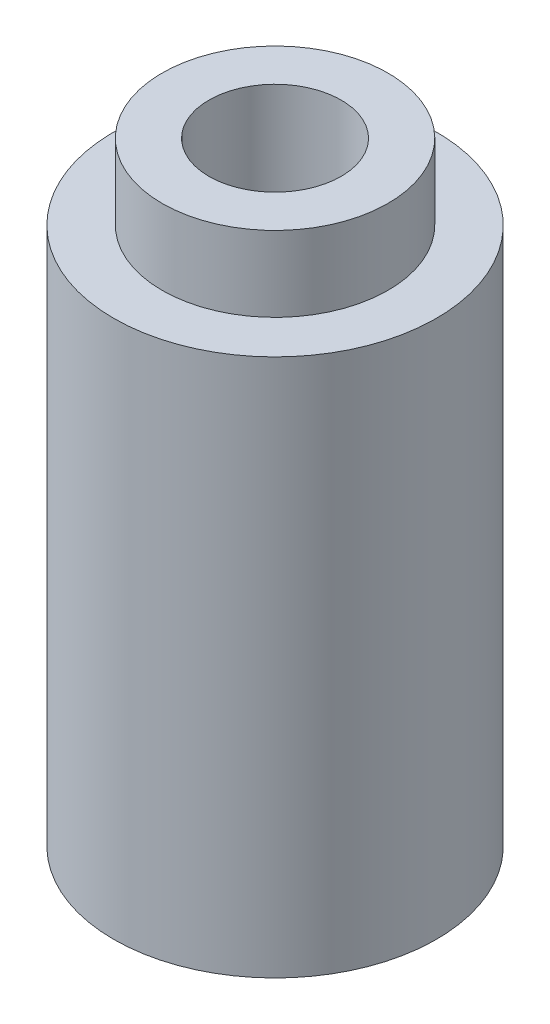
ISO-10303-21;
HEADER;
FILE_DESCRIPTION(('STEP AP214'),'2;1');
FILE_NAME('part.step','',(''),(''),'','','');
FILE_SCHEMA(('AUTOMOTIVE_DESIGN { 1 0 10303 214 1 1 1 1 }'));
ENDSEC;
DATA;
#1=APPLICATION_CONTEXT('core data for automotive mechanical design processes');
#2=APPLICATION_PROTOCOL_DEFINITION('international standard','automotive_design',2000,#1);
#3=PRODUCT_CONTEXT('',#1,'mechanical');
#4=PRODUCT('Part','Part','',(#3));
#5=PRODUCT_RELATED_PRODUCT_CATEGORY('part','',(#4));
#6=PRODUCT_DEFINITION_FORMATION('','',#4);
#7=PRODUCT_DEFINITION_CONTEXT('part definition',#1,'design');
#8=PRODUCT_DEFINITION('design','',#6,#7);
#9=PRODUCT_DEFINITION_SHAPE('','',#8);
#10=(LENGTH_UNIT() NAMED_UNIT(*) SI_UNIT(.MILLI.,.METRE.));
#11=(NAMED_UNIT(*) PLANE_ANGLE_UNIT() SI_UNIT($,.RADIAN.));
#12=(NAMED_UNIT(*) SI_UNIT($,.STERADIAN.) SOLID_ANGLE_UNIT());
#13=UNCERTAINTY_MEASURE_WITH_UNIT(LENGTH_MEASURE(1.E-05),#10,'distance_accuracy_value','');
#14=(GEOMETRIC_REPRESENTATION_CONTEXT(3) GLOBAL_UNCERTAINTY_ASSIGNED_CONTEXT((#13)) GLOBAL_UNIT_ASSIGNED_CONTEXT((#10,
#11,#12)) REPRESENTATION_CONTEXT('',''));
#15=CARTESIAN_POINT('',(0.,0.,0.));
#16=DIRECTION('',(0.,0.,1.));
#17=DIRECTION('',(1.,0.,0.));
#18=AXIS2_PLACEMENT_3D('',#15,#16,#17);
#19=CARTESIAN_POINT('',(-2.1,11.4,0.));
#20=DIRECTION('',(0.,1.,0.));
#21=DIRECTION('',(0.,0.,1.));
#22=AXIS2_PLACEMENT_3D('',#19,#20,#21);
#23=PLANE('',#22);
#24=CARTESIAN_POINT('',(0.,11.4,0.));
#25=DIRECTION('',(0.,1.,0.));
#26=DIRECTION('',(0.,0.,1.));
#27=AXIS2_PLACEMENT_3D('',#24,#25,#26);
#28=CIRCLE('',#27,1.2295);
#29=CARTESIAN_POINT('',(0.,11.4,1.2295));
#30=VERTEX_POINT('',#29);
#31=EDGE_CURVE('E34',#30,#30,#28,.F.);
#32=ORIENTED_EDGE('',*,*,#31,.T.);
#33=EDGE_LOOP('',(#32));
#34=FACE_BOUND('',#33,.T.);
#35=CARTESIAN_POINT('',(0.,11.4,0.));
#36=DIRECTION('',(0.,1.,0.));
#37=DIRECTION('',(0.,0.,1.));
#38=AXIS2_PLACEMENT_3D('',#35,#36,#37);
#39=CIRCLE('',#38,2.1);
#40=CARTESIAN_POINT('',(0.,11.4,2.1));
#41=VERTEX_POINT('',#40);
#42=EDGE_CURVE('E18',#41,#41,#39,.F.);
#43=ORIENTED_EDGE('',*,*,#42,.F.);
#44=EDGE_LOOP('',(#43));
#45=FACE_BOUND('',#44,.T.);
#46=ADVANCED_FACE('F15',(#34,#45),#23,.T.);
#47=CARTESIAN_POINT('',(0.,6.4,0.));
#48=DIRECTION('',(0.,1.,0.));
#49=DIRECTION('',(0.,0.,1.));
#50=AXIS2_PLACEMENT_3D('',#47,#48,#49);
#51=CYLINDRICAL_SURFACE('',#50,2.1);
#52=ORIENTED_EDGE('',*,*,#42,.T.);
#53=EDGE_LOOP('',(#52));
#54=FACE_BOUND('',#53,.T.);
#55=CARTESIAN_POINT('',(0.,10.,0.));
#56=DIRECTION('',(0.,1.,0.));
#57=DIRECTION('',(0.,0.,1.));
#58=AXIS2_PLACEMENT_3D('',#55,#56,#57);
#59=CIRCLE('',#58,2.1);
#60=CARTESIAN_POINT('',(0.,10.,2.1));
#61=VERTEX_POINT('',#60);
#62=EDGE_CURVE('E32',#61,#61,#59,.F.);
#63=ORIENTED_EDGE('',*,*,#62,.F.);
#64=EDGE_LOOP('',(#63));
#65=FACE_BOUND('',#64,.T.);
#66=ADVANCED_FACE('F41',(#54,#65),#51,.T.);
#67=CARTESIAN_POINT('',(0.,14.21126313879,0.));
#68=DIRECTION('',(0.,1.,0.));
#69=DIRECTION('',(0.,0.,1.));
#70=AXIS2_PLACEMENT_3D('',#67,#68,#69);
#71=CYLINDRICAL_SURFACE('',#70,1.2295);
#72=CARTESIAN_POINT('',(0.,0.,0.));
#73=DIRECTION('',(0.,1.,0.));
#74=DIRECTION('',(0.,0.,1.));
#75=AXIS2_PLACEMENT_3D('',#72,#73,#74);
#76=CIRCLE('',#75,1.2295);
#77=CARTESIAN_POINT('',(0.,0.,1.2295));
#78=VERTEX_POINT('',#77);
#79=EDGE_CURVE('E27',#78,#78,#76,.T.);
#80=ORIENTED_EDGE('',*,*,#79,.F.);
#81=EDGE_LOOP('',(#80));
#82=FACE_BOUND('',#81,.T.);
#83=ORIENTED_EDGE('',*,*,#31,.F.);
#84=EDGE_LOOP('',(#83));
#85=FACE_BOUND('',#84,.T.);
#86=ADVANCED_FACE('F49',(#82,#85),#71,.F.);
#87=CARTESIAN_POINT('',(-3.,10.,0.));
#88=DIRECTION('',(0.,1.,0.));
#89=DIRECTION('',(0.,0.,1.));
#90=AXIS2_PLACEMENT_3D('',#87,#88,#89);
#91=PLANE('',#90);
#92=ORIENTED_EDGE('',*,*,#62,.T.);
#93=EDGE_LOOP('',(#92));
#94=FACE_BOUND('',#93,.T.);
#95=CARTESIAN_POINT('',(0.,10.,0.));
#96=DIRECTION('',(0.,1.,0.));
#97=DIRECTION('',(0.,0.,1.));
#98=AXIS2_PLACEMENT_3D('',#95,#96,#97);
#99=CIRCLE('',#98,3.);
#100=CARTESIAN_POINT('',(0.,10.,3.));
#101=VERTEX_POINT('',#100);
#102=EDGE_CURVE('E22',#101,#101,#99,.F.);
#103=ORIENTED_EDGE('',*,*,#102,.F.);
#104=EDGE_LOOP('',(#103));
#105=FACE_BOUND('',#104,.T.);
#106=ADVANCED_FACE('F58',(#94,#105),#91,.T.);
#107=CARTESIAN_POINT('',(0.,0.,0.));
#108=DIRECTION('',(0.,-1.,0.));
#109=DIRECTION('',(0.,0.,-1.));
#110=AXIS2_PLACEMENT_3D('',#107,#108,#109);
#111=PLANE('',#110);
#112=ORIENTED_EDGE('',*,*,#79,.T.);
#113=EDGE_LOOP('',(#112));
#114=FACE_BOUND('',#113,.T.);
#115=CARTESIAN_POINT('',(0.,0.,0.));
#116=DIRECTION('',(0.,1.,0.));
#117=DIRECTION('',(0.,0.,1.));
#118=AXIS2_PLACEMENT_3D('',#115,#116,#117);
#119=CIRCLE('',#118,3.);
#120=CARTESIAN_POINT('',(0.,0.,3.));
#121=VERTEX_POINT('',#120);
#122=EDGE_CURVE('E10',#121,#121,#119,.T.);
#123=ORIENTED_EDGE('',*,*,#122,.F.);
#124=EDGE_LOOP('',(#123));
#125=FACE_BOUND('',#124,.T.);
#126=ADVANCED_FACE('F52',(#114,#125),#111,.T.);
#127=CARTESIAN_POINT('',(0.,6.4,0.));
#128=DIRECTION('',(0.,1.,0.));
#129=DIRECTION('',(0.,0.,1.));
#130=AXIS2_PLACEMENT_3D('',#127,#128,#129);
#131=CYLINDRICAL_SURFACE('',#130,3.);
#132=ORIENTED_EDGE('',*,*,#102,.T.);
#133=EDGE_LOOP('',(#132));
#134=FACE_BOUND('',#133,.T.);
#135=ORIENTED_EDGE('',*,*,#122,.T.);
#136=EDGE_LOOP('',(#135));
#137=FACE_BOUND('',#136,.T.);
#138=ADVANCED_FACE('F50',(#134,#137),#131,.T.);
#139=CLOSED_SHELL('',(#46,#66,#86,#106,#126,#138));
#140=MANIFOLD_SOLID_BREP('B1',#139);
#141=ADVANCED_BREP_SHAPE_REPRESENTATION('',(#18,#140),#14);
#142=SHAPE_DEFINITION_REPRESENTATION(#9,#141);
ENDSEC;
END-ISO-10303-21;
